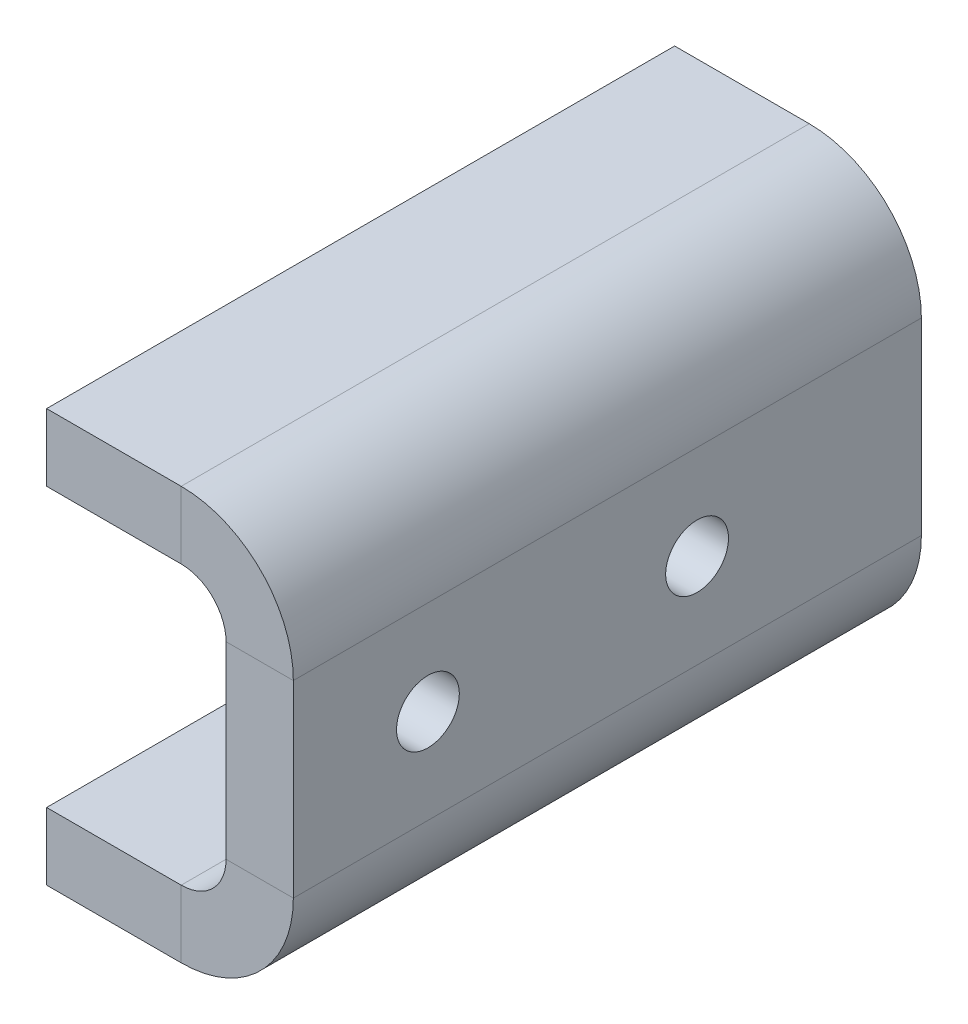
ISO-10303-21;
HEADER;
FILE_DESCRIPTION(('STEP AP214'),'2;1');
FILE_NAME('part.step','',(''),(''),'','','');
FILE_SCHEMA(('AUTOMOTIVE_DESIGN { 1 0 10303 214 1 1 1 1 }'));
ENDSEC;
DATA;
#1=APPLICATION_CONTEXT('core data for automotive mechanical design processes');
#2=APPLICATION_PROTOCOL_DEFINITION('international standard','automotive_design',2000,#1);
#3=PRODUCT_CONTEXT('',#1,'mechanical');
#4=PRODUCT('Part','Part','',(#3));
#5=PRODUCT_RELATED_PRODUCT_CATEGORY('part','',(#4));
#6=PRODUCT_DEFINITION_FORMATION('','',#4);
#7=PRODUCT_DEFINITION_CONTEXT('part definition',#1,'design');
#8=PRODUCT_DEFINITION('design','',#6,#7);
#9=PRODUCT_DEFINITION_SHAPE('','',#8);
#10=(LENGTH_UNIT() NAMED_UNIT(*) SI_UNIT(.MILLI.,.METRE.));
#11=(NAMED_UNIT(*) PLANE_ANGLE_UNIT() SI_UNIT($,.RADIAN.));
#12=(NAMED_UNIT(*) SI_UNIT($,.STERADIAN.) SOLID_ANGLE_UNIT());
#13=UNCERTAINTY_MEASURE_WITH_UNIT(LENGTH_MEASURE(1.E-05),#10,'distance_accuracy_value','');
#14=(GEOMETRIC_REPRESENTATION_CONTEXT(3) GLOBAL_UNCERTAINTY_ASSIGNED_CONTEXT((#13)) GLOBAL_UNIT_ASSIGNED_CONTEXT((#10,
#11,#12)) REPRESENTATION_CONTEXT('',''));
#15=CARTESIAN_POINT('',(0.,0.,0.));
#16=DIRECTION('',(0.,0.,1.));
#17=DIRECTION('',(1.,0.,0.));
#18=AXIS2_PLACEMENT_3D('',#15,#16,#17);
#19=CARTESIAN_POINT('',(20.,-21.,140.));
#20=DIRECTION('',(0.,0.,1.));
#21=DIRECTION('',(1.,0.,0.));
#22=AXIS2_PLACEMENT_3D('',#19,#20,#21);
#23=PLANE('',#22);
#24=DIRECTION('',(1.,0.,0.));
#25=VECTOR('',#24,1.);
#26=CARTESIAN_POINT('',(20.,-21.,140.));
#27=LINE('',#26,#25);
#28=CARTESIAN_POINT('',(20.,-21.,140.));
#29=VERTEX_POINT('',#28);
#30=CARTESIAN_POINT('',(35.,-21.,140.));
#31=VERTEX_POINT('',#30);
#32=EDGE_CURVE('E11',#29,#31,#27,.T.);
#33=ORIENTED_EDGE('',*,*,#32,.F.);
#34=CARTESIAN_POINT('',(10.,-21.,140.));
#35=DIRECTION('',(0.,0.,-1.));
#36=DIRECTION('',(-1.,0.,0.));
#37=AXIS2_PLACEMENT_3D('',#34,#35,#36);
#38=CIRCLE('',#37,10.);
#39=CARTESIAN_POINT('',(10.,-31.,140.));
#40=VERTEX_POINT('',#39);
#41=EDGE_CURVE('E174',#29,#40,#38,.T.);
#42=ORIENTED_EDGE('',*,*,#41,.T.);
#43=DIRECTION('',(0.,1.,0.));
#44=VECTOR('',#43,1.);
#45=CARTESIAN_POINT('',(10.,-46.,140.));
#46=LINE('',#45,#44);
#47=CARTESIAN_POINT('',(10.,-46.,140.));
#48=VERTEX_POINT('',#47);
#49=EDGE_CURVE('E48',#48,#40,#46,.T.);
#50=ORIENTED_EDGE('',*,*,#49,.F.);
#51=CARTESIAN_POINT('',(10.,-21.,140.));
#52=DIRECTION('',(0.,0.,1.));
#53=DIRECTION('',(1.,0.,0.));
#54=AXIS2_PLACEMENT_3D('',#51,#52,#53);
#55=CIRCLE('',#54,25.);
#56=EDGE_CURVE('E261',#31,#48,#55,.F.);
#57=ORIENTED_EDGE('',*,*,#56,.F.);
#58=EDGE_LOOP('',(#33,#42,#50,#57));
#59=FACE_BOUND('',#58,.T.);
#60=ADVANCED_FACE('F39',(#59),#23,.T.);
#61=CARTESIAN_POINT('',(10.,-46.,140.));
#62=DIRECTION('',(0.,0.,1.));
#63=DIRECTION('',(1.,0.,0.));
#64=AXIS2_PLACEMENT_3D('',#61,#62,#63);
#65=PLANE('',#64);
#66=DIRECTION('',(0.,-1.,0.));
#67=VECTOR('',#66,1.);
#68=CARTESIAN_POINT('',(20.,-31.,140.));
#69=LINE('',#68,#67);
#70=CARTESIAN_POINT('',(20.,21.,140.));
#71=VERTEX_POINT('',#70);
#72=EDGE_CURVE('E141',#71,#29,#69,.T.);
#73=ORIENTED_EDGE('',*,*,#72,.T.);
#74=ORIENTED_EDGE('',*,*,#32,.T.);
#75=DIRECTION('',(0.,1.,0.));
#76=VECTOR('',#75,1.);
#77=CARTESIAN_POINT('',(35.,-31.,140.));
#78=LINE('',#77,#76);
#79=CARTESIAN_POINT('',(35.,21.,140.));
#80=VERTEX_POINT('',#79);
#81=EDGE_CURVE('E144',#80,#31,#78,.F.);
#82=ORIENTED_EDGE('',*,*,#81,.F.);
#83=DIRECTION('',(-1.,0.,0.));
#84=VECTOR('',#83,1.);
#85=CARTESIAN_POINT('',(35.,21.,140.));
#86=LINE('',#85,#84);
#87=EDGE_CURVE('E137',#80,#71,#86,.T.);
#88=ORIENTED_EDGE('',*,*,#87,.T.);
#89=EDGE_LOOP('',(#73,#74,#82,#88));
#90=FACE_BOUND('',#89,.T.);
#91=ADVANCED_FACE('F139',(#90),#65,.T.);
#92=CARTESIAN_POINT('',(10.,-31.,0.));
#93=DIRECTION('',(0.,0.,-1.));
#94=DIRECTION('',(-1.,0.,0.));
#95=AXIS2_PLACEMENT_3D('',#92,#93,#94);
#96=PLANE('',#95);
#97=DIRECTION('',(0.,-1.,0.));
#98=VECTOR('',#97,1.);
#99=CARTESIAN_POINT('',(10.,-31.,0.));
#100=LINE('',#99,#98);
#101=CARTESIAN_POINT('',(10.,-31.,0.));
#102=VERTEX_POINT('',#101);
#103=CARTESIAN_POINT('',(10.,-46.,0.));
#104=VERTEX_POINT('',#103);
#105=EDGE_CURVE('E104',#102,#104,#100,.T.);
#106=ORIENTED_EDGE('',*,*,#105,.F.);
#107=CARTESIAN_POINT('',(10.,-21.,0.));
#108=DIRECTION('',(0.,0.,-1.));
#109=DIRECTION('',(-1.,0.,0.));
#110=AXIS2_PLACEMENT_3D('',#107,#108,#109);
#111=CIRCLE('',#110,10.);
#112=CARTESIAN_POINT('',(20.,-21.,0.));
#113=VERTEX_POINT('',#112);
#114=EDGE_CURVE('E208',#113,#102,#111,.T.);
#115=ORIENTED_EDGE('',*,*,#114,.F.);
#116=DIRECTION('',(-1.,0.,0.));
#117=VECTOR('',#116,1.);
#118=CARTESIAN_POINT('',(35.,-21.,0.));
#119=LINE('',#118,#117);
#120=CARTESIAN_POINT('',(35.,-21.,0.));
#121=VERTEX_POINT('',#120);
#122=EDGE_CURVE('E97',#121,#113,#119,.T.);
#123=ORIENTED_EDGE('',*,*,#122,.F.);
#124=CARTESIAN_POINT('',(10.,-21.,0.));
#125=DIRECTION('',(0.,0.,1.));
#126=DIRECTION('',(1.,0.,0.));
#127=AXIS2_PLACEMENT_3D('',#124,#125,#126);
#128=CIRCLE('',#127,25.);
#129=EDGE_CURVE('E189',#121,#104,#128,.F.);
#130=ORIENTED_EDGE('',*,*,#129,.T.);
#131=EDGE_LOOP('',(#106,#115,#123,#130));
#132=FACE_BOUND('',#131,.T.);
#133=ADVANCED_FACE('F298',(#132),#96,.T.);
#134=CARTESIAN_POINT('',(35.,-21.,0.));
#135=DIRECTION('',(0.,0.,-1.));
#136=DIRECTION('',(-1.,0.,0.));
#137=AXIS2_PLACEMENT_3D('',#134,#135,#136);
#138=PLANE('',#137);
#139=DIRECTION('',(-1.,0.,0.));
#140=VECTOR('',#139,1.);
#141=CARTESIAN_POINT('',(-20.,-31.,0.));
#142=LINE('',#141,#140);
#143=CARTESIAN_POINT('',(-20.,-31.,0.));
#144=VERTEX_POINT('',#143);
#145=EDGE_CURVE('E180',#102,#144,#142,.T.);
#146=ORIENTED_EDGE('',*,*,#145,.F.);
#147=ORIENTED_EDGE('',*,*,#105,.T.);
#148=DIRECTION('',(1.,0.,0.));
#149=VECTOR('',#148,1.);
#150=CARTESIAN_POINT('',(-20.,-46.,0.));
#151=LINE('',#150,#149);
#152=CARTESIAN_POINT('',(-20.,-46.,0.));
#153=VERTEX_POINT('',#152);
#154=EDGE_CURVE('E186',#104,#153,#151,.F.);
#155=ORIENTED_EDGE('',*,*,#154,.T.);
#156=DIRECTION('',(0.,1.,0.));
#157=VECTOR('',#156,1.);
#158=CARTESIAN_POINT('',(-20.,-46.,0.));
#159=LINE('',#158,#157);
#160=EDGE_CURVE('E183',#153,#144,#159,.T.);
#161=ORIENTED_EDGE('',*,*,#160,.T.);
#162=EDGE_LOOP('',(#146,#147,#155,#161));
#163=FACE_BOUND('',#162,.T.);
#164=ADVANCED_FACE('F306',(#163),#138,.T.);
#165=CARTESIAN_POINT('',(10.,31.,140.));
#166=DIRECTION('',(0.,0.,1.));
#167=DIRECTION('',(1.,0.,0.));
#168=AXIS2_PLACEMENT_3D('',#165,#166,#167);
#169=PLANE('',#168);
#170=DIRECTION('',(0.,1.,0.));
#171=VECTOR('',#170,1.);
#172=CARTESIAN_POINT('',(10.,31.,140.));
#173=LINE('',#172,#171);
#174=CARTESIAN_POINT('',(10.,31.,140.));
#175=VERTEX_POINT('',#174);
#176=CARTESIAN_POINT('',(10.,46.,140.));
#177=VERTEX_POINT('',#176);
#178=EDGE_CURVE('E149',#175,#177,#173,.T.);
#179=ORIENTED_EDGE('',*,*,#178,.F.);
#180=CARTESIAN_POINT('',(10.,21.,140.));
#181=DIRECTION('',(0.,0.,-1.));
#182=DIRECTION('',(-1.,0.,0.));
#183=AXIS2_PLACEMENT_3D('',#180,#181,#182);
#184=CIRCLE('',#183,10.);
#185=EDGE_CURVE('E153',#175,#71,#184,.T.);
#186=ORIENTED_EDGE('',*,*,#185,.T.);
#187=ORIENTED_EDGE('',*,*,#87,.F.);
#188=CARTESIAN_POINT('',(10.,21.,140.));
#189=DIRECTION('',(0.,0.,1.));
#190=DIRECTION('',(1.,0.,0.));
#191=AXIS2_PLACEMENT_3D('',#188,#189,#190);
#192=CIRCLE('',#191,25.);
#193=EDGE_CURVE('E265',#177,#80,#192,.F.);
#194=ORIENTED_EDGE('',*,*,#193,.F.);
#195=EDGE_LOOP('',(#179,#186,#187,#194));
#196=FACE_BOUND('',#195,.T.);
#197=ADVANCED_FACE('F155',(#196),#169,.T.);
#198=CARTESIAN_POINT('',(35.,21.,140.));
#199=DIRECTION('',(0.,0.,1.));
#200=DIRECTION('',(1.,0.,0.));
#201=AXIS2_PLACEMENT_3D('',#198,#199,#200);
#202=PLANE('',#201);
#203=DIRECTION('',(1.,0.,0.));
#204=VECTOR('',#203,1.);
#205=CARTESIAN_POINT('',(-20.,31.,140.));
#206=LINE('',#205,#204);
#207=CARTESIAN_POINT('',(-20.,31.,140.));
#208=VERTEX_POINT('',#207);
#209=EDGE_CURVE('E159',#208,#175,#206,.T.);
#210=ORIENTED_EDGE('',*,*,#209,.T.);
#211=ORIENTED_EDGE('',*,*,#178,.T.);
#212=DIRECTION('',(1.,0.,0.));
#213=VECTOR('',#212,1.);
#214=CARTESIAN_POINT('',(-20.,46.,140.));
#215=LINE('',#214,#213);
#216=CARTESIAN_POINT('',(-20.,46.,140.));
#217=VERTEX_POINT('',#216);
#218=EDGE_CURVE('E267',#217,#177,#215,.T.);
#219=ORIENTED_EDGE('',*,*,#218,.F.);
#220=DIRECTION('',(0.,1.,0.));
#221=VECTOR('',#220,1.);
#222=CARTESIAN_POINT('',(-20.,31.,140.));
#223=LINE('',#222,#221);
#224=EDGE_CURVE('E270',#208,#217,#223,.T.);
#225=ORIENTED_EDGE('',*,*,#224,.F.);
#226=EDGE_LOOP('',(#210,#211,#219,#225));
#227=FACE_BOUND('',#226,.T.);
#228=ADVANCED_FACE('F276',(#227),#202,.T.);
#229=CARTESIAN_POINT('',(20.,21.,0.));
#230=DIRECTION('',(0.,0.,-1.));
#231=DIRECTION('',(-1.,0.,0.));
#232=AXIS2_PLACEMENT_3D('',#229,#230,#231);
#233=PLANE('',#232);
#234=DIRECTION('',(1.,0.,0.));
#235=VECTOR('',#234,1.);
#236=CARTESIAN_POINT('',(20.,21.,0.));
#237=LINE('',#236,#235);
#238=CARTESIAN_POINT('',(20.,21.,0.));
#239=VERTEX_POINT('',#238);
#240=CARTESIAN_POINT('',(35.,21.,0.));
#241=VERTEX_POINT('',#240);
#242=EDGE_CURVE('E150',#239,#241,#237,.T.);
#243=ORIENTED_EDGE('',*,*,#242,.F.);
#244=CARTESIAN_POINT('',(10.,21.,0.));
#245=DIRECTION('',(0.,0.,-1.));
#246=DIRECTION('',(-1.,0.,0.));
#247=AXIS2_PLACEMENT_3D('',#244,#245,#246);
#248=CIRCLE('',#247,10.);
#249=CARTESIAN_POINT('',(10.,31.,0.));
#250=VERTEX_POINT('',#249);
#251=EDGE_CURVE('E166',#250,#239,#248,.T.);
#252=ORIENTED_EDGE('',*,*,#251,.F.);
#253=DIRECTION('',(0.,-1.,0.));
#254=VECTOR('',#253,1.);
#255=CARTESIAN_POINT('',(10.,46.,0.));
#256=LINE('',#255,#254);
#257=CARTESIAN_POINT('',(10.,46.,0.));
#258=VERTEX_POINT('',#257);
#259=EDGE_CURVE('E234',#258,#250,#256,.T.);
#260=ORIENTED_EDGE('',*,*,#259,.F.);
#261=CARTESIAN_POINT('',(10.,21.,0.));
#262=DIRECTION('',(0.,0.,1.));
#263=DIRECTION('',(1.,0.,0.));
#264=AXIS2_PLACEMENT_3D('',#261,#262,#263);
#265=CIRCLE('',#264,25.);
#266=EDGE_CURVE('E193',#258,#241,#265,.F.);
#267=ORIENTED_EDGE('',*,*,#266,.T.);
#268=EDGE_LOOP('',(#243,#252,#260,#267));
#269=FACE_BOUND('',#268,.T.);
#270=ADVANCED_FACE('F283',(#269),#233,.T.);
#271=CARTESIAN_POINT('',(10.,46.,0.));
#272=DIRECTION('',(0.,0.,-1.));
#273=DIRECTION('',(-1.,0.,0.));
#274=AXIS2_PLACEMENT_3D('',#271,#272,#273);
#275=PLANE('',#274);
#276=DIRECTION('',(0.,-1.,0.));
#277=VECTOR('',#276,1.);
#278=CARTESIAN_POINT('',(20.,-31.,0.));
#279=LINE('',#278,#277);
#280=EDGE_CURVE('E206',#239,#113,#279,.T.);
#281=ORIENTED_EDGE('',*,*,#280,.F.);
#282=ORIENTED_EDGE('',*,*,#242,.T.);
#283=DIRECTION('',(0.,1.,0.));
#284=VECTOR('',#283,1.);
#285=CARTESIAN_POINT('',(35.,-31.,0.));
#286=LINE('',#285,#284);
#287=EDGE_CURVE('E191',#241,#121,#286,.F.);
#288=ORIENTED_EDGE('',*,*,#287,.T.);
#289=ORIENTED_EDGE('',*,*,#122,.T.);
#290=EDGE_LOOP('',(#281,#282,#288,#289));
#291=FACE_BOUND('',#290,.T.);
#292=ADVANCED_FACE('F285',(#291),#275,.T.);
#293=CARTESIAN_POINT('',(-20.,-31.,140.));
#294=DIRECTION('',(0.,-1.,0.));
#295=DIRECTION('',(0.,0.,-1.));
#296=AXIS2_PLACEMENT_3D('',#293,#294,#295);
#297=PLANE('',#296);
#298=ORIENTED_EDGE('',*,*,#145,.T.);
#299=DIRECTION('',(0.,0.,-1.));
#300=VECTOR('',#299,1.);
#301=CARTESIAN_POINT('',(-20.,-31.,140.));
#302=LINE('',#301,#300);
#303=CARTESIAN_POINT('',(-20.,-31.,140.));
#304=VERTEX_POINT('',#303);
#305=EDGE_CURVE('E232',#304,#144,#302,.T.);
#306=ORIENTED_EDGE('',*,*,#305,.F.);
#307=DIRECTION('',(-1.,0.,0.));
#308=VECTOR('',#307,1.);
#309=CARTESIAN_POINT('',(-20.,-31.,140.));
#310=LINE('',#309,#308);
#311=EDGE_CURVE('E110',#40,#304,#310,.T.);
#312=ORIENTED_EDGE('',*,*,#311,.F.);
#313=DIRECTION('',(0.,0.,-1.));
#314=VECTOR('',#313,1.);
#315=CARTESIAN_POINT('',(10.,-31.,140.));
#316=LINE('',#315,#314);
#317=EDGE_CURVE('E176',#40,#102,#316,.T.);
#318=ORIENTED_EDGE('',*,*,#317,.T.);
#319=EDGE_LOOP('',(#298,#306,#312,#318));
#320=FACE_BOUND('',#319,.T.);
#321=ADVANCED_FACE('F304',(#320),#297,.F.);
#322=CARTESIAN_POINT('',(-20.,-46.,140.));
#323=DIRECTION('',(-1.,0.,0.));
#324=DIRECTION('',(0.,0.,1.));
#325=AXIS2_PLACEMENT_3D('',#322,#323,#324);
#326=PLANE('',#325);
#327=ORIENTED_EDGE('',*,*,#160,.F.);
#328=DIRECTION('',(0.,0.,-1.));
#329=VECTOR('',#328,1.);
#330=CARTESIAN_POINT('',(-20.,-46.,140.));
#331=LINE('',#330,#329);
#332=CARTESIAN_POINT('',(-20.,-46.,140.));
#333=VERTEX_POINT('',#332);
#334=EDGE_CURVE('E230',#333,#153,#331,.T.);
#335=ORIENTED_EDGE('',*,*,#334,.F.);
#336=DIRECTION('',(0.,1.,0.));
#337=VECTOR('',#336,1.);
#338=CARTESIAN_POINT('',(-20.,-46.,140.));
#339=LINE('',#338,#337);
#340=EDGE_CURVE('E255',#333,#304,#339,.T.);
#341=ORIENTED_EDGE('',*,*,#340,.T.);
#342=ORIENTED_EDGE('',*,*,#305,.T.);
#343=EDGE_LOOP('',(#327,#335,#341,#342));
#344=FACE_BOUND('',#343,.T.);
#345=ADVANCED_FACE('F309',(#344),#326,.T.);
#346=CARTESIAN_POINT('',(-20.,-46.,140.));
#347=DIRECTION('',(0.,-1.,0.));
#348=DIRECTION('',(0.,0.,-1.));
#349=AXIS2_PLACEMENT_3D('',#346,#347,#348);
#350=PLANE('',#349);
#351=ORIENTED_EDGE('',*,*,#154,.F.);
#352=DIRECTION('',(0.,0.,-1.));
#353=VECTOR('',#352,1.);
#354=CARTESIAN_POINT('',(10.,-46.,140.));
#355=LINE('',#354,#353);
#356=EDGE_CURVE('E227',#48,#104,#355,.T.);
#357=ORIENTED_EDGE('',*,*,#356,.F.);
#358=DIRECTION('',(1.,0.,0.));
#359=VECTOR('',#358,1.);
#360=CARTESIAN_POINT('',(-20.,-46.,140.));
#361=LINE('',#360,#359);
#362=EDGE_CURVE('E258',#48,#333,#361,.F.);
#363=ORIENTED_EDGE('',*,*,#362,.T.);
#364=ORIENTED_EDGE('',*,*,#334,.T.);
#365=EDGE_LOOP('',(#351,#357,#363,#364));
#366=FACE_BOUND('',#365,.T.);
#367=ADVANCED_FACE('F312',(#366),#350,.T.);
#368=CARTESIAN_POINT('',(10.,-21.,140.));
#369=DIRECTION('',(0.,0.,-1.));
#370=DIRECTION('',(-1.,0.,0.));
#371=AXIS2_PLACEMENT_3D('',#368,#369,#370);
#372=CYLINDRICAL_SURFACE('',#371,25.);
#373=ORIENTED_EDGE('',*,*,#129,.F.);
#374=DIRECTION('',(0.,0.,-1.));
#375=VECTOR('',#374,1.);
#376=CARTESIAN_POINT('',(35.,-21.,140.));
#377=LINE('',#376,#375);
#378=EDGE_CURVE('E224',#31,#121,#377,.T.);
#379=ORIENTED_EDGE('',*,*,#378,.F.);
#380=ORIENTED_EDGE('',*,*,#56,.T.);
#381=ORIENTED_EDGE('',*,*,#356,.T.);
#382=EDGE_LOOP('',(#373,#379,#380,#381));
#383=FACE_BOUND('',#382,.T.);
#384=ADVANCED_FACE('F295',(#383),#372,.T.);
#385=CARTESIAN_POINT('',(35.,-31.,140.));
#386=DIRECTION('',(1.,0.,0.));
#387=DIRECTION('',(0.,0.,-1.));
#388=AXIS2_PLACEMENT_3D('',#385,#386,#387);
#389=PLANE('',#388);
#390=CARTESIAN_POINT('',(35.,0.,110.));
#391=DIRECTION('',(1.,0.,0.));
#392=DIRECTION('',(0.,0.,-1.));
#393=AXIS2_PLACEMENT_3D('',#390,#391,#392);
#394=CIRCLE('',#393,7.);
#395=CARTESIAN_POINT('',(35.,0.,103.));
#396=VERTEX_POINT('',#395);
#397=EDGE_CURVE('E242',#396,#396,#394,.T.);
#398=ORIENTED_EDGE('',*,*,#397,.F.);
#399=EDGE_LOOP('',(#398));
#400=FACE_BOUND('',#399,.T.);
#401=CARTESIAN_POINT('',(35.,0.,50.));
#402=DIRECTION('',(1.,0.,0.));
#403=DIRECTION('',(0.,0.,-1.));
#404=AXIS2_PLACEMENT_3D('',#401,#402,#403);
#405=CIRCLE('',#404,7.);
#406=CARTESIAN_POINT('',(35.,0.,43.));
#407=VERTEX_POINT('',#406);
#408=EDGE_CURVE('E247',#407,#407,#405,.T.);
#409=ORIENTED_EDGE('',*,*,#408,.F.);
#410=EDGE_LOOP('',(#409));
#411=FACE_BOUND('',#410,.T.);
#412=ORIENTED_EDGE('',*,*,#287,.F.);
#413=DIRECTION('',(0.,0.,-1.));
#414=VECTOR('',#413,1.);
#415=CARTESIAN_POINT('',(35.,21.,140.));
#416=LINE('',#415,#414);
#417=EDGE_CURVE('E221',#80,#241,#416,.T.);
#418=ORIENTED_EDGE('',*,*,#417,.F.);
#419=ORIENTED_EDGE('',*,*,#81,.T.);
#420=ORIENTED_EDGE('',*,*,#378,.T.);
#421=EDGE_LOOP('',(#412,#418,#419,#420));
#422=FACE_BOUND('',#421,.T.);
#423=ADVANCED_FACE('F290',(#400,#411,#422),#389,.T.);
#424=CARTESIAN_POINT('',(10.,21.,140.));
#425=DIRECTION('',(0.,0.,-1.));
#426=DIRECTION('',(-1.,0.,0.));
#427=AXIS2_PLACEMENT_3D('',#424,#425,#426);
#428=CYLINDRICAL_SURFACE('',#427,25.);
#429=ORIENTED_EDGE('',*,*,#266,.F.);
#430=DIRECTION('',(0.,0.,-1.));
#431=VECTOR('',#430,1.);
#432=CARTESIAN_POINT('',(10.,46.,140.));
#433=LINE('',#432,#431);
#434=EDGE_CURVE('E218',#177,#258,#433,.T.);
#435=ORIENTED_EDGE('',*,*,#434,.F.);
#436=ORIENTED_EDGE('',*,*,#193,.T.);
#437=ORIENTED_EDGE('',*,*,#417,.T.);
#438=EDGE_LOOP('',(#429,#435,#436,#437));
#439=FACE_BOUND('',#438,.T.);
#440=ADVANCED_FACE('F288',(#439),#428,.T.);
#441=CARTESIAN_POINT('',(-20.,46.,140.));
#442=DIRECTION('',(0.,1.,0.));
#443=DIRECTION('',(0.,0.,1.));
#444=AXIS2_PLACEMENT_3D('',#441,#442,#443);
#445=PLANE('',#444);
#446=DIRECTION('',(1.,0.,0.));
#447=VECTOR('',#446,1.);
#448=CARTESIAN_POINT('',(-20.,46.,0.));
#449=LINE('',#448,#447);
#450=CARTESIAN_POINT('',(-20.,46.,0.));
#451=VERTEX_POINT('',#450);
#452=EDGE_CURVE('E196',#451,#258,#449,.T.);
#453=ORIENTED_EDGE('',*,*,#452,.F.);
#454=DIRECTION('',(0.,0.,-1.));
#455=VECTOR('',#454,1.);
#456=CARTESIAN_POINT('',(-20.,46.,140.));
#457=LINE('',#456,#455);
#458=EDGE_CURVE('E216',#217,#451,#457,.T.);
#459=ORIENTED_EDGE('',*,*,#458,.F.);
#460=ORIENTED_EDGE('',*,*,#218,.T.);
#461=ORIENTED_EDGE('',*,*,#434,.T.);
#462=EDGE_LOOP('',(#453,#459,#460,#461));
#463=FACE_BOUND('',#462,.T.);
#464=ADVANCED_FACE('F374',(#463),#445,.T.);
#465=CARTESIAN_POINT('',(-20.,31.,140.));
#466=DIRECTION('',(-1.,0.,0.));
#467=DIRECTION('',(0.,0.,1.));
#468=AXIS2_PLACEMENT_3D('',#465,#466,#467);
#469=PLANE('',#468);
#470=DIRECTION('',(0.,1.,0.));
#471=VECTOR('',#470,1.);
#472=CARTESIAN_POINT('',(-20.,31.,0.));
#473=LINE('',#472,#471);
#474=CARTESIAN_POINT('',(-20.,31.,0.));
#475=VERTEX_POINT('',#474);
#476=EDGE_CURVE('E199',#475,#451,#473,.T.);
#477=ORIENTED_EDGE('',*,*,#476,.F.);
#478=DIRECTION('',(0.,0.,-1.));
#479=VECTOR('',#478,1.);
#480=CARTESIAN_POINT('',(-20.,31.,140.));
#481=LINE('',#480,#479);
#482=EDGE_CURVE('E214',#208,#475,#481,.T.);
#483=ORIENTED_EDGE('',*,*,#482,.F.);
#484=ORIENTED_EDGE('',*,*,#224,.T.);
#485=ORIENTED_EDGE('',*,*,#458,.T.);
#486=EDGE_LOOP('',(#477,#483,#484,#485));
#487=FACE_BOUND('',#486,.T.);
#488=ADVANCED_FACE('F384',(#487),#469,.T.);
#489=CARTESIAN_POINT('',(-20.,31.,140.));
#490=DIRECTION('',(0.,1.,0.));
#491=DIRECTION('',(0.,0.,1.));
#492=AXIS2_PLACEMENT_3D('',#489,#490,#491);
#493=PLANE('',#492);
#494=DIRECTION('',(1.,0.,0.));
#495=VECTOR('',#494,1.);
#496=CARTESIAN_POINT('',(-20.,31.,0.));
#497=LINE('',#496,#495);
#498=EDGE_CURVE('E202',#475,#250,#497,.T.);
#499=ORIENTED_EDGE('',*,*,#498,.T.);
#500=DIRECTION('',(0.,0.,-1.));
#501=VECTOR('',#500,1.);
#502=CARTESIAN_POINT('',(10.,31.,140.));
#503=LINE('',#502,#501);
#504=EDGE_CURVE('E168',#175,#250,#503,.T.);
#505=ORIENTED_EDGE('',*,*,#504,.F.);
#506=ORIENTED_EDGE('',*,*,#209,.F.);
#507=ORIENTED_EDGE('',*,*,#482,.T.);
#508=EDGE_LOOP('',(#499,#505,#506,#507));
#509=FACE_BOUND('',#508,.T.);
#510=ADVANCED_FACE('F280',(#509),#493,.F.);
#511=CARTESIAN_POINT('',(10.,21.,140.));
#512=DIRECTION('',(0.,0.,-1.));
#513=DIRECTION('',(-1.,0.,0.));
#514=AXIS2_PLACEMENT_3D('',#511,#512,#513);
#515=CYLINDRICAL_SURFACE('',#514,10.);
#516=ORIENTED_EDGE('',*,*,#251,.T.);
#517=DIRECTION('',(0.,0.,-1.));
#518=VECTOR('',#517,1.);
#519=CARTESIAN_POINT('',(20.,21.,140.));
#520=LINE('',#519,#518);
#521=EDGE_CURVE('E163',#71,#239,#520,.T.);
#522=ORIENTED_EDGE('',*,*,#521,.F.);
#523=ORIENTED_EDGE('',*,*,#185,.F.);
#524=ORIENTED_EDGE('',*,*,#504,.T.);
#525=EDGE_LOOP('',(#516,#522,#523,#524));
#526=FACE_BOUND('',#525,.T.);
#527=ADVANCED_FACE('F164',(#526),#515,.F.);
#528=CARTESIAN_POINT('',(20.,-31.,140.));
#529=DIRECTION('',(1.,0.,0.));
#530=DIRECTION('',(0.,0.,-1.));
#531=AXIS2_PLACEMENT_3D('',#528,#529,#530);
#532=PLANE('',#531);
#533=CARTESIAN_POINT('',(20.,0.,110.));
#534=DIRECTION('',(1.,0.,0.));
#535=DIRECTION('',(0.,0.,-1.));
#536=AXIS2_PLACEMENT_3D('',#533,#534,#535);
#537=CIRCLE('',#536,7.);
#538=CARTESIAN_POINT('',(20.,0.,103.));
#539=VERTEX_POINT('',#538);
#540=EDGE_CURVE('E42',#539,#539,#537,.T.);
#541=ORIENTED_EDGE('',*,*,#540,.T.);
#542=EDGE_LOOP('',(#541));
#543=FACE_BOUND('',#542,.T.);
#544=CARTESIAN_POINT('',(20.,0.,50.));
#545=DIRECTION('',(1.,0.,0.));
#546=DIRECTION('',(0.,0.,-1.));
#547=AXIS2_PLACEMENT_3D('',#544,#545,#546);
#548=CIRCLE('',#547,7.);
#549=CARTESIAN_POINT('',(20.,0.,43.));
#550=VERTEX_POINT('',#549);
#551=EDGE_CURVE('E240',#550,#550,#548,.T.);
#552=ORIENTED_EDGE('',*,*,#551,.T.);
#553=EDGE_LOOP('',(#552));
#554=FACE_BOUND('',#553,.T.);
#555=ORIENTED_EDGE('',*,*,#280,.T.);
#556=DIRECTION('',(0.,0.,-1.));
#557=VECTOR('',#556,1.);
#558=CARTESIAN_POINT('',(20.,-21.,140.));
#559=LINE('',#558,#557);
#560=EDGE_CURVE('E169',#29,#113,#559,.T.);
#561=ORIENTED_EDGE('',*,*,#560,.F.);
#562=ORIENTED_EDGE('',*,*,#72,.F.);
#563=ORIENTED_EDGE('',*,*,#521,.T.);
#564=EDGE_LOOP('',(#555,#561,#562,#563));
#565=FACE_BOUND('',#564,.T.);
#566=ADVANCED_FACE('F171',(#543,#554,#565),#532,.F.);
#567=CARTESIAN_POINT('',(10.,-21.,140.));
#568=DIRECTION('',(0.,0.,-1.));
#569=DIRECTION('',(-1.,0.,0.));
#570=AXIS2_PLACEMENT_3D('',#567,#568,#569);
#571=CYLINDRICAL_SURFACE('',#570,10.);
#572=ORIENTED_EDGE('',*,*,#114,.T.);
#573=ORIENTED_EDGE('',*,*,#317,.F.);
#574=ORIENTED_EDGE('',*,*,#41,.F.);
#575=ORIENTED_EDGE('',*,*,#560,.T.);
#576=EDGE_LOOP('',(#572,#573,#574,#575));
#577=FACE_BOUND('',#576,.T.);
#578=ADVANCED_FACE('F301',(#577),#571,.F.);
#579=CARTESIAN_POINT('',(10.,-21.,140.));
#580=DIRECTION('',(0.,0.,1.));
#581=DIRECTION('',(1.,0.,0.));
#582=AXIS2_PLACEMENT_3D('',#579,#580,#581);
#583=PLANE('',#582);
#584=ORIENTED_EDGE('',*,*,#311,.T.);
#585=ORIENTED_EDGE('',*,*,#340,.F.);
#586=ORIENTED_EDGE('',*,*,#362,.F.);
#587=ORIENTED_EDGE('',*,*,#49,.T.);
#588=EDGE_LOOP('',(#584,#585,#586,#587));
#589=FACE_BOUND('',#588,.T.);
#590=ADVANCED_FACE('F310',(#589),#583,.T.);
#591=CARTESIAN_POINT('',(10.,-21.,0.));
#592=DIRECTION('',(0.,0.,1.));
#593=DIRECTION('',(1.,0.,0.));
#594=AXIS2_PLACEMENT_3D('',#591,#592,#593);
#595=PLANE('',#594);
#596=ORIENTED_EDGE('',*,*,#452,.T.);
#597=ORIENTED_EDGE('',*,*,#259,.T.);
#598=ORIENTED_EDGE('',*,*,#498,.F.);
#599=ORIENTED_EDGE('',*,*,#476,.T.);
#600=EDGE_LOOP('',(#596,#597,#598,#599));
#601=FACE_BOUND('',#600,.T.);
#602=ADVANCED_FACE('F434',(#601),#595,.F.);
#603=CARTESIAN_POINT('',(-20.,0.,50.));
#604=DIRECTION('',(1.,0.,0.));
#605=DIRECTION('',(0.,0.,-1.));
#606=AXIS2_PLACEMENT_3D('',#603,#604,#605);
#607=CYLINDRICAL_SURFACE('',#606,7.);
#608=ORIENTED_EDGE('',*,*,#408,.T.);
#609=EDGE_LOOP('',(#608));
#610=FACE_BOUND('',#609,.T.);
#611=ORIENTED_EDGE('',*,*,#551,.F.);
#612=EDGE_LOOP('',(#611));
#613=FACE_BOUND('',#612,.T.);
#614=ADVANCED_FACE('F444',(#610,#613),#607,.F.);
#615=CARTESIAN_POINT('',(-20.,0.,110.));
#616=DIRECTION('',(1.,0.,0.));
#617=DIRECTION('',(0.,0.,-1.));
#618=AXIS2_PLACEMENT_3D('',#615,#616,#617);
#619=CYLINDRICAL_SURFACE('',#618,7.);
#620=ORIENTED_EDGE('',*,*,#397,.T.);
#621=EDGE_LOOP('',(#620));
#622=FACE_BOUND('',#621,.T.);
#623=ORIENTED_EDGE('',*,*,#540,.F.);
#624=EDGE_LOOP('',(#623));
#625=FACE_BOUND('',#624,.T.);
#626=ADVANCED_FACE('F471',(#622,#625),#619,.F.);
#627=CLOSED_SHELL('',(#60,#91,#133,#164,#197,#228,#270,#292,#321,#345,#367,#384,#423,#440,#464,
#488,#510,#527,#566,#578,#590,#602,#614,#626));
#628=MANIFOLD_SOLID_BREP('B2',#627);
#629=ADVANCED_BREP_SHAPE_REPRESENTATION('',(#18,#628),#14);
#630=SHAPE_DEFINITION_REPRESENTATION(#9,#629);
ENDSEC;
END-ISO-10303-21;
